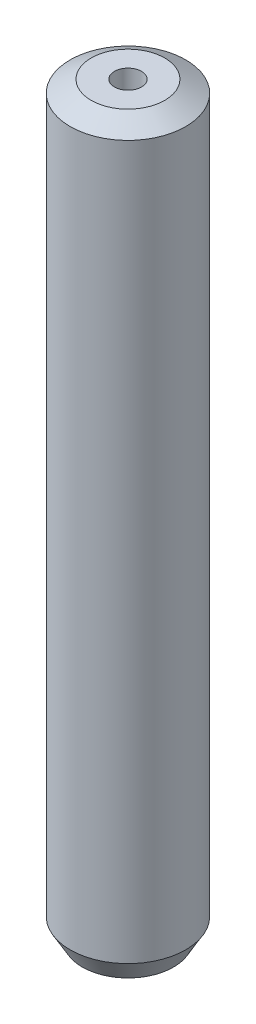
ISO-10303-21;
HEADER;
FILE_DESCRIPTION(('STEP AP214'),'2;1');
FILE_NAME('part.step','',(''),(''),'','','');
FILE_SCHEMA(('AUTOMOTIVE_DESIGN { 1 0 10303 214 1 1 1 1 }'));
ENDSEC;
DATA;
#1=APPLICATION_CONTEXT('core data for automotive mechanical design processes');
#2=APPLICATION_PROTOCOL_DEFINITION('international standard','automotive_design',2000,#1);
#3=PRODUCT_CONTEXT('',#1,'mechanical');
#4=PRODUCT('Part','Part','',(#3));
#5=PRODUCT_RELATED_PRODUCT_CATEGORY('part','',(#4));
#6=PRODUCT_DEFINITION_FORMATION('','',#4);
#7=PRODUCT_DEFINITION_CONTEXT('part definition',#1,'design');
#8=PRODUCT_DEFINITION('design','',#6,#7);
#9=PRODUCT_DEFINITION_SHAPE('','',#8);
#10=(LENGTH_UNIT() NAMED_UNIT(*) SI_UNIT(.MILLI.,.METRE.));
#11=(NAMED_UNIT(*) PLANE_ANGLE_UNIT() SI_UNIT($,.RADIAN.));
#12=(NAMED_UNIT(*) SI_UNIT($,.STERADIAN.) SOLID_ANGLE_UNIT());
#13=UNCERTAINTY_MEASURE_WITH_UNIT(LENGTH_MEASURE(1.E-05),#10,'distance_accuracy_value','');
#14=(GEOMETRIC_REPRESENTATION_CONTEXT(3) GLOBAL_UNCERTAINTY_ASSIGNED_CONTEXT((#13)) GLOBAL_UNIT_ASSIGNED_CONTEXT((#10,
#11,#12)) REPRESENTATION_CONTEXT('',''));
#15=CARTESIAN_POINT('',(0.,0.,0.));
#16=DIRECTION('',(0.,0.,1.));
#17=DIRECTION('',(1.,0.,0.));
#18=AXIS2_PLACEMENT_3D('',#15,#16,#17);
#19=CARTESIAN_POINT('',(0.,96.799986057947,0.));
#20=DIRECTION('',(0.,-1.,0.));
#21=DIRECTION('',(0.,0.,-1.));
#22=AXIS2_PLACEMENT_3D('',#19,#20,#21);
#23=CYLINDRICAL_SURFACE('',#22,7.5);
#24=CARTESIAN_POINT('',(0.,95.2234089335971,0.));
#25=DIRECTION('',(0.,1.,0.));
#26=DIRECTION('',(0.,0.,1.));
#27=AXIS2_PLACEMENT_3D('',#24,#25,#26);
#28=CIRCLE('',#27,7.5);
#29=CARTESIAN_POINT('',(0.,95.2234089335971,7.5));
#30=VERTEX_POINT('',#29);
#31=EDGE_CURVE('E50',#30,#30,#28,.F.);
#32=ORIENTED_EDGE('',*,*,#31,.T.);
#33=EDGE_LOOP('',(#32));
#34=FACE_BOUND('',#33,.T.);
#35=CARTESIAN_POINT('',(0.,2.73071168142475,0.));
#36=DIRECTION('',(0.,1.,0.));
#37=DIRECTION('',(0.,0.,1.));
#38=AXIS2_PLACEMENT_3D('',#35,#36,#37);
#39=CIRCLE('',#38,7.5);
#40=CARTESIAN_POINT('',(0.,2.73071168142475,7.5));
#41=VERTEX_POINT('',#40);
#42=EDGE_CURVE('E51',#41,#41,#39,.T.);
#43=ORIENTED_EDGE('',*,*,#42,.T.);
#44=EDGE_LOOP('',(#43));
#45=FACE_BOUND('',#44,.T.);
#46=ADVANCED_FACE('F39',(#34,#45),#23,.T.);
#47=CARTESIAN_POINT('',(0.,96.799986057947,0.));
#48=DIRECTION('',(0.,1.,0.));
#49=DIRECTION('',(0.,0.,1.));
#50=AXIS2_PLACEMENT_3D('',#47,#48,#49);
#51=PLANE('',#50);
#52=CARTESIAN_POINT('',(0.,96.799986057947,0.));
#53=DIRECTION('',(0.,1.,0.));
#54=DIRECTION('',(0.,0.,1.));
#55=AXIS2_PLACEMENT_3D('',#52,#53,#54);
#56=CIRCLE('',#55,4.76928831857522);
#57=CARTESIAN_POINT('',(0.,96.799986057947,4.76928831857522));
#58=VERTEX_POINT('',#57);
#59=EDGE_CURVE('E54',#58,#58,#56,.T.);
#60=ORIENTED_EDGE('',*,*,#59,.T.);
#61=EDGE_LOOP('',(#60));
#62=FACE_BOUND('',#61,.T.);
#63=CARTESIAN_POINT('',(0.,96.799986057947,0.));
#64=DIRECTION('',(0.,1.,0.));
#65=DIRECTION('',(0.,0.,1.));
#66=AXIS2_PLACEMENT_3D('',#63,#64,#65);
#67=CIRCLE('',#66,1.75843732717386);
#68=CARTESIAN_POINT('',(0.,96.799986057947,1.75843732717386));
#69=VERTEX_POINT('',#68);
#70=EDGE_CURVE('E58',#69,#69,#67,.T.);
#71=ORIENTED_EDGE('',*,*,#70,.F.);
#72=EDGE_LOOP('',(#71));
#73=FACE_BOUND('',#72,.T.);
#74=ADVANCED_FACE('F69',(#62,#73),#51,.T.);
#75=CARTESIAN_POINT('',(0.,0.,0.));
#76=DIRECTION('',(0.,1.,0.));
#77=DIRECTION('',(0.,0.,1.));
#78=AXIS2_PLACEMENT_3D('',#75,#76,#77);
#79=PLANE('',#78);
#80=CARTESIAN_POINT('',(0.,0.,0.));
#81=DIRECTION('',(0.,1.,0.));
#82=DIRECTION('',(0.,0.,1.));
#83=AXIS2_PLACEMENT_3D('',#80,#81,#82);
#84=CIRCLE('',#83,5.92342287565016);
#85=CARTESIAN_POINT('',(0.,0.,5.92342287565016));
#86=VERTEX_POINT('',#85);
#87=EDGE_CURVE('E10',#86,#86,#84,.F.);
#88=ORIENTED_EDGE('',*,*,#87,.T.);
#89=EDGE_LOOP('',(#88));
#90=FACE_BOUND('',#89,.T.);
#91=CARTESIAN_POINT('',(0.,0.,0.));
#92=DIRECTION('',(0.,1.,0.));
#93=DIRECTION('',(0.,0.,1.));
#94=AXIS2_PLACEMENT_3D('',#91,#92,#93);
#95=CIRCLE('',#94,1.75843732717386);
#96=CARTESIAN_POINT('',(0.,0.,1.75843732717386));
#97=VERTEX_POINT('',#96);
#98=EDGE_CURVE('E63',#97,#97,#95,.T.);
#99=ORIENTED_EDGE('',*,*,#98,.T.);
#100=EDGE_LOOP('',(#99));
#101=FACE_BOUND('',#100,.T.);
#102=ADVANCED_FACE('F75',(#90,#101),#79,.F.);
#103=CARTESIAN_POINT('',(0.,96.799986057947,0.));
#104=DIRECTION('',(0.,-1.,0.));
#105=DIRECTION('',(0.,0.,-1.));
#106=AXIS2_PLACEMENT_3D('',#103,#104,#105);
#107=CYLINDRICAL_SURFACE('',#106,1.75843732717386);
#108=ORIENTED_EDGE('',*,*,#70,.T.);
#109=EDGE_LOOP('',(#108));
#110=FACE_BOUND('',#109,.T.);
#111=ORIENTED_EDGE('',*,*,#98,.F.);
#112=EDGE_LOOP('',(#111));
#113=FACE_BOUND('',#112,.T.);
#114=ADVANCED_FACE('F70',(#110,#113),#107,.F.);
#115=CARTESIAN_POINT('',(0.,96.799986057947,0.));
#116=DIRECTION('',(0.,-1.,0.));
#117=DIRECTION('',(0.,0.,-1.));
#118=AXIS2_PLACEMENT_3D('',#115,#116,#117);
#119=CONICAL_SURFACE('',#118,4.76928831857522,1.0471975511966);
#120=ORIENTED_EDGE('',*,*,#31,.F.);
#121=EDGE_LOOP('',(#120));
#122=FACE_BOUND('',#121,.T.);
#123=ORIENTED_EDGE('',*,*,#59,.F.);
#124=EDGE_LOOP('',(#123));
#125=FACE_BOUND('',#124,.T.);
#126=ADVANCED_FACE('F81',(#122,#125),#119,.T.);
#127=CARTESIAN_POINT('',(0.,2.73071168142475,0.));
#128=DIRECTION('',(0.,1.,0.));
#129=DIRECTION('',(0.,0.,1.));
#130=AXIS2_PLACEMENT_3D('',#127,#128,#129);
#131=CONICAL_SURFACE('',#130,7.5,0.5235987755983);
#132=ORIENTED_EDGE('',*,*,#87,.F.);
#133=EDGE_LOOP('',(#132));
#134=FACE_BOUND('',#133,.T.);
#135=ORIENTED_EDGE('',*,*,#42,.F.);
#136=EDGE_LOOP('',(#135));
#137=FACE_BOUND('',#136,.T.);
#138=ADVANCED_FACE('F45',(#134,#137),#131,.T.);
#139=CLOSED_SHELL('',(#46,#74,#102,#114,#126,#138));
#140=MANIFOLD_SOLID_BREP('B2',#139);
#141=ADVANCED_BREP_SHAPE_REPRESENTATION('',(#18,#140),#14);
#142=SHAPE_DEFINITION_REPRESENTATION(#9,#141);
ENDSEC;
END-ISO-10303-21;
